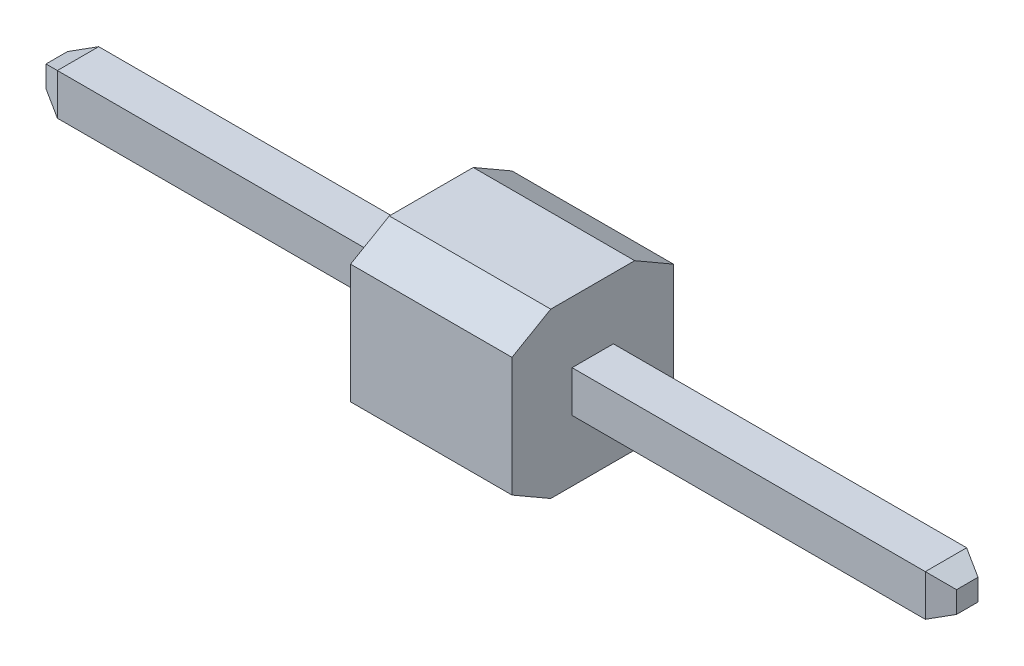
ISO-10303-21;
HEADER;
FILE_DESCRIPTION(('STEP AP214'),'2;1');
FILE_NAME('part.step','',(''),(''),'','','');
FILE_SCHEMA(('AUTOMOTIVE_DESIGN { 1 0 10303 214 1 1 1 1 }'));
ENDSEC;
DATA;
#1=APPLICATION_CONTEXT('core data for automotive mechanical design processes');
#2=APPLICATION_PROTOCOL_DEFINITION('international standard','automotive_design',2000,#1);
#3=PRODUCT_CONTEXT('',#1,'mechanical');
#4=PRODUCT('Part','Part','',(#3));
#5=PRODUCT_RELATED_PRODUCT_CATEGORY('part','',(#4));
#6=PRODUCT_DEFINITION_FORMATION('','',#4);
#7=PRODUCT_DEFINITION_CONTEXT('part definition',#1,'design');
#8=PRODUCT_DEFINITION('design','',#6,#7);
#9=PRODUCT_DEFINITION_SHAPE('','',#8);
#10=(LENGTH_UNIT() NAMED_UNIT(*) SI_UNIT(.MILLI.,.METRE.));
#11=(NAMED_UNIT(*) PLANE_ANGLE_UNIT() SI_UNIT($,.RADIAN.));
#12=(NAMED_UNIT(*) SI_UNIT($,.STERADIAN.) SOLID_ANGLE_UNIT());
#13=UNCERTAINTY_MEASURE_WITH_UNIT(LENGTH_MEASURE(1.E-05),#10,'distance_accuracy_value','');
#14=(GEOMETRIC_REPRESENTATION_CONTEXT(3) GLOBAL_UNCERTAINTY_ASSIGNED_CONTEXT((#13)) GLOBAL_UNIT_ASSIGNED_CONTEXT((#10,
#11,#12)) REPRESENTATION_CONTEXT('',''));
#15=CARTESIAN_POINT('',(0.,0.,0.));
#16=DIRECTION('',(0.,0.,1.));
#17=DIRECTION('',(1.,0.,0.));
#18=AXIS2_PLACEMENT_3D('',#15,#16,#17);
#19=CARTESIAN_POINT('',(5.42107461246523,7.30287173708609,0.629998634255617));
#20=DIRECTION('',(1.,4.37113882867379E-08,-4.37113882867379E-08));
#21=DIRECTION('',(-4.37113882867379E-08,1.,0.));
#22=AXIS2_PLACEMENT_3D('',#19,#20,#21);
#23=PLANE('',#22);
#24=DIRECTION('',(1.59994790123753E-08,0.50000000000019,0.866025403784329));
#25=VECTOR('',#24,1.);
#26=CARTESIAN_POINT('',(5.42107448947931,8.54646157557208,-0.940001365744382));
#27=LINE('',#26,#25);
#28=CARTESIAN_POINT('',(5.42107448947931,8.54646157557208,-0.940001365744382));
#29=VERTEX_POINT('',#28);
#30=CARTESIAN_POINT('',(5.42107450056408,8.89287173708609,-0.340001365744383));
#31=VERTEX_POINT('',#30);
#32=EDGE_CURVE('E11',#29,#31,#27,.T.);
#33=ORIENTED_EDGE('',*,*,#32,.T.);
#34=DIRECTION('',(4.37113886966664E-08,0.,0.999999999999999));
#35=VECTOR('',#34,1.);
#36=CARTESIAN_POINT('',(5.42107450056408,8.89287173708609,-0.340001365744383));
#37=LINE('',#36,#35);
#38=CARTESIAN_POINT('',(5.42107455738888,8.89287173708609,0.959998634255618));
#39=VERTEX_POINT('',#38);
#40=EDGE_CURVE('E304',#31,#39,#37,.T.);
#41=ORIENTED_EDGE('',*,*,#40,.T.);
#42=DIRECTION('',(5.97108656004285E-08,-0.500000000000188,0.866025403784328));
#43=VECTOR('',#42,1.);
#44=CARTESIAN_POINT('',(5.42107455738888,8.89287173708609,0.959998634255618));
#45=LINE('',#44,#43);
#46=CARTESIAN_POINT('',(5.42107459875778,8.54646157557209,1.55999863425562));
#47=VERTEX_POINT('',#46);
#48=EDGE_CURVE('E296',#39,#47,#45,.T.);
#49=ORIENTED_EDGE('',*,*,#48,.T.);
#50=DIRECTION('',(4.37113884815072E-08,-0.999999999999999,0.));
#51=VECTOR('',#50,1.);
#52=CARTESIAN_POINT('',(5.42107459875778,8.54646157557209,1.55999863425562));
#53=LINE('',#52,#51);
#54=CARTESIAN_POINT('',(5.42107467950057,6.69928189860009,1.55999863425562));
#55=VERTEX_POINT('',#54);
#56=EDGE_CURVE('E281',#47,#55,#53,.T.);
#57=ORIENTED_EDGE('',*,*,#56,.T.);
#58=DIRECTION('',(1.59994777304001E-08,0.500000000000191,0.866025403784328));
#59=VECTOR('',#58,1.);
#60=CARTESIAN_POINT('',(5.42107466841581,6.35287173708609,0.959998634255618));
#61=LINE('',#60,#59);
#62=CARTESIAN_POINT('',(5.42107466841581,6.35287173708609,0.959998634255618));
#63=VERTEX_POINT('',#62);
#64=EDGE_CURVE('E265',#63,#55,#61,.T.);
#65=ORIENTED_EDGE('',*,*,#64,.F.);
#66=DIRECTION('',(4.37113886966664E-08,0.,0.999999999999999));
#67=VECTOR('',#66,1.);
#68=CARTESIAN_POINT('',(5.421074611591,6.35287173708609,-0.340001365744383));
#69=LINE('',#68,#67);
#70=CARTESIAN_POINT('',(5.421074611591,6.35287173708609,-0.340001365744383));
#71=VERTEX_POINT('',#70);
#72=EDGE_CURVE('E248',#71,#63,#69,.T.);
#73=ORIENTED_EDGE('',*,*,#72,.F.);
#74=DIRECTION('',(5.97108668824036E-08,-0.500000000000189,0.866025403784328));
#75=VECTOR('',#74,1.);
#76=CARTESIAN_POINT('',(5.4210745702221,6.69928189860009,-0.940001365744382));
#77=LINE('',#76,#75);
#78=CARTESIAN_POINT('',(5.4210745702221,6.69928189860009,-0.940001365744382));
#79=VERTEX_POINT('',#78);
#80=EDGE_CURVE('E242',#79,#71,#77,.T.);
#81=ORIENTED_EDGE('',*,*,#80,.F.);
#82=DIRECTION('',(4.37113884815072E-08,-0.999999999999999,0.));
#83=VECTOR('',#82,1.);
#84=CARTESIAN_POINT('',(5.42107448947931,8.54646157557208,-0.940001365744382));
#85=LINE('',#84,#83);
#86=EDGE_CURVE('E236',#29,#79,#85,.T.);
#87=ORIENTED_EDGE('',*,*,#86,.F.);
#88=EDGE_LOOP('',(#33,#41,#49,#57,#65,#73,#81,#87));
#89=FACE_BOUND('',#88,.T.);
#90=DIRECTION('',(-4.37113886753159E-08,0.,-0.999999999999999));
#91=VECTOR('',#90,1.);
#92=CARTESIAN_POINT('',(5.42107458448994,7.94287173708609,0.629998634255617));
#93=LINE('',#92,#91);
#94=CARTESIAN_POINT('',(5.42107458448994,7.94287173708609,0.629998634255617));
#95=VERTEX_POINT('',#94);
#96=CARTESIAN_POINT('',(5.42107455651465,7.94287173708609,-0.0100013657443826));
#97=VERTEX_POINT('',#96);
#98=EDGE_CURVE('E302',#95,#97,#93,.T.);
#99=ORIENTED_EDGE('',*,*,#98,.T.);
#100=DIRECTION('',(-4.3711388675316E-08,0.999999999999999,0.));
#101=VECTOR('',#100,1.);
#102=CARTESIAN_POINT('',(5.42107458448994,7.30287173708609,-0.0100013657443826));
#103=LINE('',#102,#101);
#104=CARTESIAN_POINT('',(5.42107458448994,7.30287173708609,-0.0100013657443826));
#105=VERTEX_POINT('',#104);
#106=EDGE_CURVE('E293',#105,#97,#103,.T.);
#107=ORIENTED_EDGE('',*,*,#106,.F.);
#108=DIRECTION('',(-4.37113886753159E-08,0.,-0.999999999999999));
#109=VECTOR('',#108,1.);
#110=CARTESIAN_POINT('',(5.42107461246523,7.30287173708609,0.629998634255617));
#111=LINE('',#110,#109);
#112=CARTESIAN_POINT('',(5.42107461246523,7.30287173708609,0.629998634255617));
#113=VERTEX_POINT('',#112);
#114=EDGE_CURVE('E278',#113,#105,#111,.T.);
#115=ORIENTED_EDGE('',*,*,#114,.F.);
#116=DIRECTION('',(-4.3711388675316E-08,0.999999999999999,0.));
#117=VECTOR('',#116,1.);
#118=CARTESIAN_POINT('',(5.42107461246523,7.30287173708609,0.629998634255617));
#119=LINE('',#118,#117);
#120=EDGE_CURVE('E263',#113,#95,#119,.T.);
#121=ORIENTED_EDGE('',*,*,#120,.T.);
#122=EDGE_LOOP('',(#99,#107,#115,#121));
#123=FACE_BOUND('',#122,.T.);
#124=ADVANCED_FACE('F17',(#89,#123),#23,.T.);
#125=CARTESIAN_POINT('',(2.92107461246523,7.30287162780762,0.629998743534088));
#126=DIRECTION('',(1.,4.37113882867379E-08,-4.37113882867379E-08));
#127=DIRECTION('',(-4.37113882867379E-08,1.,0.));
#128=AXIS2_PLACEMENT_3D('',#125,#126,#127);
#129=PLANE('',#128);
#130=DIRECTION('',(1.59994783713877E-08,0.50000000000019,0.866025403784329));
#131=VECTOR('',#130,1.);
#132=CARTESIAN_POINT('',(2.92107448947931,8.54646146629361,-0.940001256465912));
#133=LINE('',#132,#131);
#134=CARTESIAN_POINT('',(2.92107448947931,8.54646146629361,-0.940001256465912));
#135=VERTEX_POINT('',#134);
#136=CARTESIAN_POINT('',(2.92107450056408,8.89287162780762,-0.340001256465912));
#137=VERTEX_POINT('',#136);
#138=EDGE_CURVE('E24',#135,#137,#133,.T.);
#139=ORIENTED_EDGE('',*,*,#138,.F.);
#140=DIRECTION('',(4.37113882410924E-08,-0.999999999999999,0.));
#141=VECTOR('',#140,1.);
#142=CARTESIAN_POINT('',(2.92107448947931,8.54646146629361,-0.940001256465912));
#143=LINE('',#142,#141);
#144=CARTESIAN_POINT('',(2.9210745702221,6.69928178932161,-0.940001256465912));
#145=VERTEX_POINT('',#144);
#146=EDGE_CURVE('E300',#135,#145,#143,.T.);
#147=ORIENTED_EDGE('',*,*,#146,.T.);
#148=DIRECTION('',(5.97108668824036E-08,-0.500000000000189,0.866025403784328));
#149=VECTOR('',#148,1.);
#150=CARTESIAN_POINT('',(2.9210745702221,6.69928178932161,-0.940001256465912));
#151=LINE('',#150,#149);
#152=CARTESIAN_POINT('',(2.921074611591,6.35287162780762,-0.340001256465912));
#153=VERTEX_POINT('',#152);
#154=EDGE_CURVE('E286',#145,#153,#151,.T.);
#155=ORIENTED_EDGE('',*,*,#154,.T.);
#156=DIRECTION('',(4.37113883550593E-08,0.,0.999999999999999));
#157=VECTOR('',#156,1.);
#158=CARTESIAN_POINT('',(2.921074611591,6.35287162780762,-0.340001256465912));
#159=LINE('',#158,#157);
#160=CARTESIAN_POINT('',(2.92107466841581,6.35287162780762,0.959998743534088));
#161=VERTEX_POINT('',#160);
#162=EDGE_CURVE('E271',#153,#161,#159,.T.);
#163=ORIENTED_EDGE('',*,*,#162,.T.);
#164=DIRECTION('',(1.59994783713877E-08,0.500000000000191,0.866025403784328));
#165=VECTOR('',#164,1.);
#166=CARTESIAN_POINT('',(2.92107466841581,6.35287162780762,0.959998743534088));
#167=LINE('',#166,#165);
#168=CARTESIAN_POINT('',(2.92107467950057,6.69928178932162,1.55999874353409));
#169=VERTEX_POINT('',#168);
#170=EDGE_CURVE('E253',#161,#169,#167,.T.);
#171=ORIENTED_EDGE('',*,*,#170,.T.);
#172=DIRECTION('',(4.37113882410924E-08,-0.999999999999999,0.));
#173=VECTOR('',#172,1.);
#174=CARTESIAN_POINT('',(2.92107459875778,8.54646146629362,1.55999874353409));
#175=LINE('',#174,#173);
#176=CARTESIAN_POINT('',(2.92107459875778,8.54646146629362,1.55999874353409));
#177=VERTEX_POINT('',#176);
#178=EDGE_CURVE('E261',#177,#169,#175,.T.);
#179=ORIENTED_EDGE('',*,*,#178,.F.);
#180=DIRECTION('',(5.97108668824036E-08,-0.500000000000188,0.866025403784328));
#181=VECTOR('',#180,1.);
#182=CARTESIAN_POINT('',(2.92107455738888,8.89287162780762,0.959998743534088));
#183=LINE('',#182,#181);
#184=CARTESIAN_POINT('',(2.92107455738888,8.89287162780762,0.959998743534088));
#185=VERTEX_POINT('',#184);
#186=EDGE_CURVE('E276',#185,#177,#183,.T.);
#187=ORIENTED_EDGE('',*,*,#186,.F.);
#188=DIRECTION('',(4.37113883550593E-08,0.,0.999999999999999));
#189=VECTOR('',#188,1.);
#190=CARTESIAN_POINT('',(2.92107450056408,8.89287162780762,-0.340001256465912));
#191=LINE('',#190,#189);
#192=EDGE_CURVE('E291',#137,#185,#191,.T.);
#193=ORIENTED_EDGE('',*,*,#192,.F.);
#194=EDGE_LOOP('',(#139,#147,#155,#163,#171,#179,#187,#193));
#195=FACE_BOUND('',#194,.T.);
#196=DIRECTION('',(-4.37113879814266E-08,0.999999999999999,0.));
#197=VECTOR('',#196,1.);
#198=CARTESIAN_POINT('',(2.92107458448994,7.30287162780762,-0.0100012564659119));
#199=LINE('',#198,#197);
#200=CARTESIAN_POINT('',(2.92107458448994,7.30287162780762,-0.0100012564659119));
#201=VERTEX_POINT('',#200);
#202=CARTESIAN_POINT('',(2.92107455651465,7.94287162780762,-0.0100012564659119));
#203=VERTEX_POINT('',#202);
#204=EDGE_CURVE('E298',#201,#203,#199,.T.);
#205=ORIENTED_EDGE('',*,*,#204,.T.);
#206=DIRECTION('',(-4.37113879814266E-08,0.,-0.999999999999999));
#207=VECTOR('',#206,1.);
#208=CARTESIAN_POINT('',(2.92107458448994,7.94287162780762,0.629998743534088));
#209=LINE('',#208,#207);
#210=CARTESIAN_POINT('',(2.92107458448994,7.94287162780762,0.629998743534088));
#211=VERTEX_POINT('',#210);
#212=EDGE_CURVE('E283',#211,#203,#209,.T.);
#213=ORIENTED_EDGE('',*,*,#212,.F.);
#214=DIRECTION('',(-4.3711388675316E-08,0.999999999999999,0.));
#215=VECTOR('',#214,1.);
#216=CARTESIAN_POINT('',(2.92107461246523,7.30287162780762,0.629998743534088));
#217=LINE('',#216,#215);
#218=CARTESIAN_POINT('',(2.92107461246523,7.30287162780762,0.629998743534088));
#219=VERTEX_POINT('',#218);
#220=EDGE_CURVE('E268',#219,#211,#217,.T.);
#221=ORIENTED_EDGE('',*,*,#220,.F.);
#222=DIRECTION('',(-4.37113886753159E-08,0.,-0.999999999999999));
#223=VECTOR('',#222,1.);
#224=CARTESIAN_POINT('',(2.92107461246523,7.30287162780762,0.629998743534088));
#225=LINE('',#224,#223);
#226=EDGE_CURVE('E251',#219,#201,#225,.T.);
#227=ORIENTED_EDGE('',*,*,#226,.T.);
#228=EDGE_LOOP('',(#205,#213,#221,#227));
#229=FACE_BOUND('',#228,.T.);
#230=ADVANCED_FACE('F314',(#195,#229),#129,.F.);
#231=CARTESIAN_POINT('',(5.42107448947931,8.54646157557208,-0.940001365744382));
#232=DIRECTION('',(5.97108668343731E-08,-0.866025403784328,0.50000000000019));
#233=DIRECTION('',(-1.59994785476185E-08,-0.500000000000192,-0.866025403784329));
#234=AXIS2_PLACEMENT_3D('',#231,#232,#233);
#235=PLANE('',#234);
#236=ORIENTED_EDGE('',*,*,#138,.T.);
#237=DIRECTION('',(-0.999999999999998,-4.37113882867378E-08,4.37113883755557E-08));
#238=VECTOR('',#237,1.);
#239=CARTESIAN_POINT('',(5.42107450056408,8.89287173708609,-0.340001365744383));
#240=LINE('',#239,#238);
#241=EDGE_CURVE('E288',#31,#137,#240,.T.);
#242=ORIENTED_EDGE('',*,*,#241,.F.);
#243=ORIENTED_EDGE('',*,*,#32,.F.);
#244=DIRECTION('',(-0.999999999999998,-4.37113882867378E-08,4.37113881091022E-08));
#245=VECTOR('',#244,1.);
#246=CARTESIAN_POINT('',(5.42107448947931,8.54646157557208,-0.940001365744382));
#247=LINE('',#246,#245);
#248=EDGE_CURVE('E256',#29,#135,#247,.T.);
#249=ORIENTED_EDGE('',*,*,#248,.T.);
#250=EDGE_LOOP('',(#236,#242,#243,#249));
#251=FACE_BOUND('',#250,.T.);
#252=ADVANCED_FACE('F306',(#251),#235,.F.);
#253=CARTESIAN_POINT('',(5.42107450056408,8.89287173708609,-0.340001365744383));
#254=DIRECTION('',(4.37113882867379E-08,-1.,0.));
#255=DIRECTION('',(1.,4.37113882867379E-08,-4.37113882867379E-08));
#256=AXIS2_PLACEMENT_3D('',#253,#254,#255);
#257=PLANE('',#256);
#258=ORIENTED_EDGE('',*,*,#192,.T.);
#259=DIRECTION('',(-0.999999999999998,-4.37113882867378E-08,4.37113882867378E-08));
#260=VECTOR('',#259,1.);
#261=CARTESIAN_POINT('',(5.42107455738888,8.89287173708609,0.959998634255618));
#262=LINE('',#261,#260);
#263=EDGE_CURVE('E273',#39,#185,#262,.T.);
#264=ORIENTED_EDGE('',*,*,#263,.F.);
#265=ORIENTED_EDGE('',*,*,#40,.F.);
#266=ORIENTED_EDGE('',*,*,#241,.T.);
#267=EDGE_LOOP('',(#258,#264,#265,#266));
#268=FACE_BOUND('',#267,.T.);
#269=ADVANCED_FACE('F311',(#268),#257,.F.);
#270=CARTESIAN_POINT('',(5.42107455738888,8.89287173708609,0.959998634255618));
#271=DIRECTION('',(1.59994785476185E-08,-0.86602540378433,-0.50000000000019));
#272=DIRECTION('',(-5.97108668343731E-08,0.500000000000188,-0.866025403784329));
#273=AXIS2_PLACEMENT_3D('',#270,#271,#272);
#274=PLANE('',#273);
#275=ORIENTED_EDGE('',*,*,#186,.T.);
#276=DIRECTION('',(-0.999999999999998,-4.37113875761951E-08,4.37113882867378E-08));
#277=VECTOR('',#276,1.);
#278=CARTESIAN_POINT('',(5.42107459875778,8.54646157557209,1.55999863425562));
#279=LINE('',#278,#277);
#280=EDGE_CURVE('E258',#47,#177,#279,.T.);
#281=ORIENTED_EDGE('',*,*,#280,.F.);
#282=ORIENTED_EDGE('',*,*,#48,.F.);
#283=ORIENTED_EDGE('',*,*,#263,.T.);
#284=EDGE_LOOP('',(#275,#281,#282,#283));
#285=FACE_BOUND('',#284,.T.);
#286=ADVANCED_FACE('F319',(#285),#274,.F.);
#287=CARTESIAN_POINT('',(5.42107459875778,8.54646157557209,1.55999863425562));
#288=DIRECTION('',(-4.37113882867379E-08,0.,-1.));
#289=DIRECTION('',(-1.,-4.37113882867379E-08,4.37113882867379E-08));
#290=AXIS2_PLACEMENT_3D('',#287,#288,#289);
#291=PLANE('',#290);
#292=ORIENTED_EDGE('',*,*,#178,.T.);
#293=DIRECTION('',(-0.999999999999998,-4.37113882867378E-08,4.37113882867378E-08));
#294=VECTOR('',#293,1.);
#295=CARTESIAN_POINT('',(5.42107467950057,6.69928189860009,1.55999863425562));
#296=LINE('',#295,#294);
#297=EDGE_CURVE('E245',#55,#169,#296,.T.);
#298=ORIENTED_EDGE('',*,*,#297,.F.);
#299=ORIENTED_EDGE('',*,*,#56,.F.);
#300=ORIENTED_EDGE('',*,*,#280,.T.);
#301=EDGE_LOOP('',(#292,#298,#299,#300));
#302=FACE_BOUND('',#301,.T.);
#303=ADVANCED_FACE('F326',(#302),#291,.F.);
#304=CARTESIAN_POINT('',(5.42107466841581,6.35287173708609,0.959998634255618));
#305=DIRECTION('',(5.97108668343731E-08,-0.866025403784328,0.50000000000019));
#306=DIRECTION('',(-1.59994785476185E-08,-0.500000000000192,-0.866025403784329));
#307=AXIS2_PLACEMENT_3D('',#304,#305,#306);
#308=PLANE('',#307);
#309=ORIENTED_EDGE('',*,*,#170,.F.);
#310=DIRECTION('',(-0.999999999999998,-4.37113886420092E-08,4.37113882867378E-08));
#311=VECTOR('',#310,1.);
#312=CARTESIAN_POINT('',(5.42107466841581,6.35287173708609,0.959998634255618));
#313=LINE('',#312,#311);
#314=EDGE_CURVE('E239',#63,#161,#313,.T.);
#315=ORIENTED_EDGE('',*,*,#314,.F.);
#316=ORIENTED_EDGE('',*,*,#64,.T.);
#317=ORIENTED_EDGE('',*,*,#297,.T.);
#318=EDGE_LOOP('',(#309,#315,#316,#317));
#319=FACE_BOUND('',#318,.T.);
#320=ADVANCED_FACE('F329',(#319),#308,.T.);
#321=CARTESIAN_POINT('',(5.421074611591,6.35287173708609,-0.340001365744383));
#322=DIRECTION('',(4.37113882867379E-08,-1.,0.));
#323=DIRECTION('',(1.,4.37113882867379E-08,-4.37113882867379E-08));
#324=AXIS2_PLACEMENT_3D('',#321,#322,#323);
#325=PLANE('',#324);
#326=ORIENTED_EDGE('',*,*,#162,.F.);
#327=DIRECTION('',(-0.999999999999998,-4.37113886420092E-08,4.37113883755557E-08));
#328=VECTOR('',#327,1.);
#329=CARTESIAN_POINT('',(5.421074611591,6.35287173708609,-0.340001365744383));
#330=LINE('',#329,#328);
#331=EDGE_CURVE('E233',#71,#153,#330,.T.);
#332=ORIENTED_EDGE('',*,*,#331,.F.);
#333=ORIENTED_EDGE('',*,*,#72,.T.);
#334=ORIENTED_EDGE('',*,*,#314,.T.);
#335=EDGE_LOOP('',(#326,#332,#333,#334));
#336=FACE_BOUND('',#335,.T.);
#337=ADVANCED_FACE('F333',(#336),#325,.T.);
#338=CARTESIAN_POINT('',(5.4210745702221,6.69928189860009,-0.940001365744382));
#339=DIRECTION('',(1.59994785476185E-08,-0.86602540378433,-0.50000000000019));
#340=DIRECTION('',(-5.97108668343731E-08,0.500000000000188,-0.866025403784329));
#341=AXIS2_PLACEMENT_3D('',#338,#339,#340);
#342=PLANE('',#341);
#343=ORIENTED_EDGE('',*,*,#154,.F.);
#344=DIRECTION('',(-0.999999999999998,-4.37113882867378E-08,4.37113881091022E-08));
#345=VECTOR('',#344,1.);
#346=CARTESIAN_POINT('',(5.4210745702221,6.69928189860009,-0.940001365744382));
#347=LINE('',#346,#345);
#348=EDGE_CURVE('E230',#79,#145,#347,.T.);
#349=ORIENTED_EDGE('',*,*,#348,.F.);
#350=ORIENTED_EDGE('',*,*,#80,.T.);
#351=ORIENTED_EDGE('',*,*,#331,.T.);
#352=EDGE_LOOP('',(#343,#349,#350,#351));
#353=FACE_BOUND('',#352,.T.);
#354=ADVANCED_FACE('F337',(#353),#342,.T.);
#355=CARTESIAN_POINT('',(5.42107448947931,8.54646157557208,-0.940001365744382));
#356=DIRECTION('',(-4.37113882867379E-08,0.,-1.));
#357=DIRECTION('',(-4.37113882867379E-08,1.,0.));
#358=AXIS2_PLACEMENT_3D('',#355,#356,#357);
#359=PLANE('',#358);
#360=ORIENTED_EDGE('',*,*,#146,.F.);
#361=ORIENTED_EDGE('',*,*,#248,.F.);
#362=ORIENTED_EDGE('',*,*,#86,.T.);
#363=ORIENTED_EDGE('',*,*,#348,.T.);
#364=EDGE_LOOP('',(#360,#361,#362,#363));
#365=FACE_BOUND('',#364,.T.);
#366=ADVANCED_FACE('F339',(#365),#359,.T.);
#367=CARTESIAN_POINT('',(-2.87892538753477,7.30287137428157,0.62999899706014));
#368=DIRECTION('',(-1.,-4.37113882867379E-08,4.37113882867379E-08));
#369=DIRECTION('',(4.37113882867379E-08,-1.,0.));
#370=AXIS2_PLACEMENT_3D('',#367,#368,#369);
#371=PLANE('',#370);
#372=DIRECTION('',(4.37113847280434E-08,-0.999999999999999,0.));
#373=VECTOR('',#372,1.);
#374=CARTESIAN_POINT('',(-2.8789254300326,7.78898984709056,0.14388052425114));
#375=LINE('',#374,#373);
#376=CARTESIAN_POINT('',(-2.8789254300326,7.78898984709056,0.14388052425114));
#377=VERTEX_POINT('',#376);
#378=CARTESIAN_POINT('',(-2.87892541551006,7.45675290147256,0.14388052425114));
#379=VERTEX_POINT('',#378);
#380=EDGE_CURVE('E228',#377,#379,#375,.T.);
#381=ORIENTED_EDGE('',*,*,#380,.T.);
#382=DIRECTION('',(4.37113874013716E-08,0.,0.999999999999999));
#383=VECTOR('',#382,1.);
#384=CARTESIAN_POINT('',(-2.87892541551006,7.45675290147256,0.14388052425114));
#385=LINE('',#384,#383);
#386=CARTESIAN_POINT('',(-2.87892540098752,7.45675290147257,0.47611746986914));
#387=VERTEX_POINT('',#386);
#388=EDGE_CURVE('E223',#379,#387,#385,.T.);
#389=ORIENTED_EDGE('',*,*,#388,.T.);
#390=DIRECTION('',(-4.37113900746999E-08,0.999999999999999,0.));
#391=VECTOR('',#390,1.);
#392=CARTESIAN_POINT('',(-2.87892540098752,7.45675290147257,0.47611746986914));
#393=LINE('',#392,#391);
#394=CARTESIAN_POINT('',(-2.87892541551006,7.78898984709057,0.47611746986914));
#395=VERTEX_POINT('',#394);
#396=EDGE_CURVE('E215',#387,#395,#393,.T.);
#397=ORIENTED_EDGE('',*,*,#396,.T.);
#398=DIRECTION('',(-4.37113820547151E-08,0.,-0.999999999999999));
#399=VECTOR('',#398,1.);
#400=CARTESIAN_POINT('',(-2.87892541551006,7.78898984709057,0.47611746986914));
#401=LINE('',#400,#399);
#402=EDGE_CURVE('E207',#395,#377,#401,.T.);
#403=ORIENTED_EDGE('',*,*,#402,.T.);
#404=EDGE_LOOP('',(#381,#389,#397,#403));
#405=FACE_BOUND('',#404,.T.);
#406=ADVANCED_FACE('F341',(#405),#371,.T.);
#407=CARTESIAN_POINT('',(-2.87892538753477,7.30287137428157,0.62999899706014));
#408=DIRECTION('',(4.37113882867379E-08,-1.,0.));
#409=DIRECTION('',(-4.37113882867379E-08,0.,-1.));
#410=AXIS2_PLACEMENT_3D('',#407,#408,#409);
#411=PLANE('',#410);
#412=DIRECTION('',(0.999999999999998,4.37113886829271E-08,-4.37113882769955E-08));
#413=VECTOR('',#412,1.);
#414=CARTESIAN_POINT('',(-2.54892538753477,7.30287138870632,0.629998982635382));
#415=LINE('',#414,#413);
#416=CARTESIAN_POINT('',(-2.54892538753477,7.30287138870632,0.629998982635382));
#417=VERTEX_POINT('',#416);
#418=EDGE_CURVE('E225',#417,#219,#415,.T.);
#419=ORIENTED_EDGE('',*,*,#418,.F.);
#420=DIRECTION('',(-4.37113886753159E-08,0.,-0.999999999999999));
#421=VECTOR('',#420,1.);
#422=CARTESIAN_POINT('',(-2.54892538753477,7.30287138870632,0.629998982635382));
#423=LINE('',#422,#421);
#424=CARTESIAN_POINT('',(-2.54892541551006,7.30287138870632,-0.010001017364618));
#425=VERTEX_POINT('',#424);
#426=EDGE_CURVE('E217',#417,#425,#423,.T.);
#427=ORIENTED_EDGE('',*,*,#426,.T.);
#428=DIRECTION('',(0.999999999999998,4.37113886829271E-08,-4.37113882161057E-08));
#429=VECTOR('',#428,1.);
#430=CARTESIAN_POINT('',(-2.54892541551006,7.30287138870632,-0.010001017364618));
#431=LINE('',#430,#429);
#432=EDGE_CURVE('E220',#425,#201,#431,.T.);
#433=ORIENTED_EDGE('',*,*,#432,.T.);
#434=ORIENTED_EDGE('',*,*,#226,.F.);
#435=EDGE_LOOP('',(#419,#427,#433,#434));
#436=FACE_BOUND('',#435,.T.);
#437=ADVANCED_FACE('F348',(#436),#411,.T.);
#438=CARTESIAN_POINT('',(-2.87892541551006,7.30287137428156,-0.0100010029398598));
#439=DIRECTION('',(-4.37113882867379E-08,0.,-1.));
#440=DIRECTION('',(-1.,-4.37113882867379E-08,4.37113882867379E-08));
#441=AXIS2_PLACEMENT_3D('',#438,#439,#440);
#442=PLANE('',#441);
#443=ORIENTED_EDGE('',*,*,#432,.F.);
#444=DIRECTION('',(-4.3711388675316E-08,0.999999999999999,0.));
#445=VECTOR('',#444,1.);
#446=CARTESIAN_POINT('',(-2.54892541551006,7.30287138870632,-0.010001017364618));
#447=LINE('',#446,#445);
#448=CARTESIAN_POINT('',(-2.54892544348535,7.94287138870632,-0.010001017364618));
#449=VERTEX_POINT('',#448);
#450=EDGE_CURVE('E209',#425,#449,#447,.T.);
#451=ORIENTED_EDGE('',*,*,#450,.T.);
#452=DIRECTION('',(0.999999999999998,4.37113881958092E-08,-4.37113882161057E-08));
#453=VECTOR('',#452,1.);
#454=CARTESIAN_POINT('',(-2.54892544348535,7.94287138870632,-0.010001017364618));
#455=LINE('',#454,#453);
#456=EDGE_CURVE('E212',#449,#203,#455,.T.);
#457=ORIENTED_EDGE('',*,*,#456,.T.);
#458=ORIENTED_EDGE('',*,*,#204,.F.);
#459=EDGE_LOOP('',(#443,#451,#457,#458));
#460=FACE_BOUND('',#459,.T.);
#461=ADVANCED_FACE('F424',(#460),#442,.T.);
#462=CARTESIAN_POINT('',(-2.87892541551006,7.94287137428156,0.62999899706014));
#463=DIRECTION('',(4.37113882867379E-08,-1.,0.));
#464=DIRECTION('',(-4.37113882867379E-08,0.,-1.));
#465=AXIS2_PLACEMENT_3D('',#462,#463,#464);
#466=PLANE('',#465);
#467=ORIENTED_EDGE('',*,*,#456,.F.);
#468=DIRECTION('',(4.37113900630947E-08,0.,0.999999999999999));
#469=VECTOR('',#468,1.);
#470=CARTESIAN_POINT('',(-2.54892544348535,7.94287138870632,-0.010001017364618));
#471=LINE('',#470,#469);
#472=CARTESIAN_POINT('',(-2.54892541551006,7.94287138870632,0.629998982635382));
#473=VERTEX_POINT('',#472);
#474=EDGE_CURVE('E201',#449,#473,#471,.T.);
#475=ORIENTED_EDGE('',*,*,#474,.T.);
#476=DIRECTION('',(0.999999999999998,4.37113881958092E-08,-4.37113882769955E-08));
#477=VECTOR('',#476,1.);
#478=CARTESIAN_POINT('',(-2.54892541551006,7.94287138870632,0.629998982635382));
#479=LINE('',#478,#477);
#480=EDGE_CURVE('E204',#473,#211,#479,.T.);
#481=ORIENTED_EDGE('',*,*,#480,.T.);
#482=ORIENTED_EDGE('',*,*,#212,.T.);
#483=EDGE_LOOP('',(#467,#475,#481,#482));
#484=FACE_BOUND('',#483,.T.);
#485=ADVANCED_FACE('F421',(#484),#466,.F.);
#486=CARTESIAN_POINT('',(-2.87892538753477,7.30287137428157,0.62999899706014));
#487=DIRECTION('',(-4.37113882867379E-08,0.,-1.));
#488=DIRECTION('',(-1.,-4.37113882867379E-08,4.37113882867379E-08));
#489=AXIS2_PLACEMENT_3D('',#486,#487,#488);
#490=PLANE('',#489);
#491=ORIENTED_EDGE('',*,*,#480,.F.);
#492=DIRECTION('',(4.37113872875372E-08,-0.999999999999999,0.));
#493=VECTOR('',#492,1.);
#494=CARTESIAN_POINT('',(-2.54892541551006,7.94287138870632,0.629998982635382));
#495=LINE('',#494,#493);
#496=EDGE_CURVE('E196',#473,#417,#495,.T.);
#497=ORIENTED_EDGE('',*,*,#496,.T.);
#498=ORIENTED_EDGE('',*,*,#418,.T.);
#499=ORIENTED_EDGE('',*,*,#220,.T.);
#500=EDGE_LOOP('',(#491,#497,#498,#499));
#501=FACE_BOUND('',#500,.T.);
#502=ADVANCED_FACE('F376',(#501),#490,.F.);
#503=CARTESIAN_POINT('',(-2.87892538753477,7.30287137428157,0.62999899706014));
#504=DIRECTION('',(-4.37113882867379E-08,0.,-1.));
#505=DIRECTION('',(-1.,-4.37113882867379E-08,4.37113882867379E-08));
#506=AXIS2_PLACEMENT_3D('',#503,#504,#505);
#507=PLANE('',#506);
#508=DIRECTION('',(0.999999999999998,4.37113883581818E-08,-4.37113882769955E-08));
#509=VECTOR('',#508,1.);
#510=CARTESIAN_POINT('',(5.42107461246523,7.30287173708609,0.629998634255617));
#511=LINE('',#510,#509);
#512=CARTESIAN_POINT('',(10.8910746124652,7.30287197618738,0.629998395154324));
#513=VERTEX_POINT('',#512);
#514=EDGE_CURVE('E199',#113,#513,#511,.T.);
#515=ORIENTED_EDGE('',*,*,#514,.T.);
#516=DIRECTION('',(-4.37113900630947E-08,0.999999999999999,0.));
#517=VECTOR('',#516,1.);
#518=CARTESIAN_POINT('',(10.8910746124652,7.30287197618738,0.629998395154324));
#519=LINE('',#518,#517);
#520=CARTESIAN_POINT('',(10.8910745844899,7.94287197618738,0.629998395154324));
#521=VERTEX_POINT('',#520);
#522=EDGE_CURVE('E191',#513,#521,#519,.T.);
#523=ORIENTED_EDGE('',*,*,#522,.T.);
#524=DIRECTION('',(0.999999999999998,4.37113883581818E-08,-4.37113882769955E-08));
#525=VECTOR('',#524,1.);
#526=CARTESIAN_POINT('',(5.42107458448994,7.94287173708609,0.629998634255617));
#527=LINE('',#526,#525);
#528=EDGE_CURVE('E194',#95,#521,#527,.T.);
#529=ORIENTED_EDGE('',*,*,#528,.F.);
#530=ORIENTED_EDGE('',*,*,#120,.F.);
#531=EDGE_LOOP('',(#515,#523,#529,#530));
#532=FACE_BOUND('',#531,.T.);
#533=ADVANCED_FACE('F367',(#532),#507,.F.);
#534=CARTESIAN_POINT('',(-2.87892541551006,7.94287137428156,0.62999899706014));
#535=DIRECTION('',(4.37113882867379E-08,-1.,0.));
#536=DIRECTION('',(-4.37113882867379E-08,0.,-1.));
#537=AXIS2_PLACEMENT_3D('',#534,#535,#536);
#538=PLANE('',#537);
#539=ORIENTED_EDGE('',*,*,#528,.T.);
#540=DIRECTION('',(-4.37113900630947E-08,0.,-0.999999999999999));
#541=VECTOR('',#540,1.);
#542=CARTESIAN_POINT('',(10.8910745844899,7.94287197618738,0.629998395154324));
#543=LINE('',#542,#541);
#544=CARTESIAN_POINT('',(10.8910745565147,7.94287197618738,-0.0100016048456765));
#545=VERTEX_POINT('',#544);
#546=EDGE_CURVE('E186',#521,#545,#543,.T.);
#547=ORIENTED_EDGE('',*,*,#546,.T.);
#548=DIRECTION('',(0.999999999999998,4.37113883581818E-08,-4.37113881146228E-08));
#549=VECTOR('',#548,1.);
#550=CARTESIAN_POINT('',(5.42107455651465,7.94287173708609,-0.0100013657443823));
#551=LINE('',#550,#549);
#552=EDGE_CURVE('E189',#97,#545,#551,.T.);
#553=ORIENTED_EDGE('',*,*,#552,.F.);
#554=ORIENTED_EDGE('',*,*,#98,.F.);
#555=EDGE_LOOP('',(#539,#547,#553,#554));
#556=FACE_BOUND('',#555,.T.);
#557=ADVANCED_FACE('F364',(#556),#538,.F.);
#558=CARTESIAN_POINT('',(-2.87892541551006,7.30287137428156,-0.0100010029398598));
#559=DIRECTION('',(-4.37113882867379E-08,0.,-1.));
#560=DIRECTION('',(-1.,-4.37113882867379E-08,4.37113882867379E-08));
#561=AXIS2_PLACEMENT_3D('',#558,#559,#560);
#562=PLANE('',#561);
#563=ORIENTED_EDGE('',*,*,#552,.T.);
#564=DIRECTION('',(4.37113872875372E-08,-0.999999999999999,0.));
#565=VECTOR('',#564,1.);
#566=CARTESIAN_POINT('',(10.8910745565147,7.94287197618738,-0.0100016048456766));
#567=LINE('',#566,#565);
#568=CARTESIAN_POINT('',(10.8910745844899,7.30287197618738,-0.0100016048456765));
#569=VERTEX_POINT('',#568);
#570=EDGE_CURVE('E176',#545,#569,#567,.T.);
#571=ORIENTED_EDGE('',*,*,#570,.T.);
#572=DIRECTION('',(0.999999999999998,4.37113883581818E-08,-4.37113881146228E-08));
#573=VECTOR('',#572,1.);
#574=CARTESIAN_POINT('',(5.42107458448994,7.30287173708609,-0.0100013657443823));
#575=LINE('',#574,#573);
#576=EDGE_CURVE('E179',#105,#569,#575,.T.);
#577=ORIENTED_EDGE('',*,*,#576,.F.);
#578=ORIENTED_EDGE('',*,*,#106,.T.);
#579=EDGE_LOOP('',(#563,#571,#577,#578));
#580=FACE_BOUND('',#579,.T.);
#581=ADVANCED_FACE('F366',(#580),#562,.T.);
#582=CARTESIAN_POINT('',(-2.87892538753477,7.30287137428157,0.62999899706014));
#583=DIRECTION('',(4.37113882867379E-08,-1.,0.));
#584=DIRECTION('',(-4.37113882867379E-08,0.,-1.));
#585=AXIS2_PLACEMENT_3D('',#582,#583,#584);
#586=PLANE('',#585);
#587=ORIENTED_EDGE('',*,*,#576,.T.);
#588=DIRECTION('',(4.37113845119796E-08,0.,0.999999999999999));
#589=VECTOR('',#588,1.);
#590=CARTESIAN_POINT('',(10.8910745844899,7.30287197618738,-0.0100016048456765));
#591=LINE('',#590,#589);
#592=EDGE_CURVE('E167',#569,#513,#591,.T.);
#593=ORIENTED_EDGE('',*,*,#592,.T.);
#594=ORIENTED_EDGE('',*,*,#514,.F.);
#595=ORIENTED_EDGE('',*,*,#114,.T.);
#596=EDGE_LOOP('',(#587,#593,#594,#595));
#597=FACE_BOUND('',#596,.T.);
#598=ADVANCED_FACE('F373',(#597),#586,.T.);
#599=CARTESIAN_POINT('',(11.2210746124652,7.30287199061214,0.629998380729565));
#600=DIRECTION('',(-1.,-4.37113882867379E-08,4.37113882867379E-08));
#601=DIRECTION('',(4.37113882867379E-08,-1.,0.));
#602=AXIS2_PLACEMENT_3D('',#599,#600,#601);
#603=PLANE('',#602);
#604=DIRECTION('',(-4.37113927480282E-08,0.999999999999999,0.));
#605=VECTOR('',#604,1.);
#606=CARTESIAN_POINT('',(11.2210745844899,7.45675351780314,0.143879907920565));
#607=LINE('',#606,#605);
#608=CARTESIAN_POINT('',(11.2210745844899,7.45675351780314,0.143879907920565));
#609=VERTEX_POINT('',#608);
#610=CARTESIAN_POINT('',(11.2210745699674,7.78899046342114,0.143879907920565));
#611=VERTEX_POINT('',#610);
#612=EDGE_CURVE('E153',#609,#611,#607,.T.);
#613=ORIENTED_EDGE('',*,*,#612,.T.);
#614=DIRECTION('',(4.37113927480282E-08,0.,0.999999999999999));
#615=VECTOR('',#614,1.);
#616=CARTESIAN_POINT('',(11.2210745699674,7.78899046342114,0.143879907920565));
#617=LINE('',#616,#615);
#618=CARTESIAN_POINT('',(11.2210745844899,7.78899046342114,0.476116853538565));
#619=VERTEX_POINT('',#618);
#620=EDGE_CURVE('E395',#611,#619,#617,.T.);
#621=ORIENTED_EDGE('',*,*,#620,.T.);
#622=DIRECTION('',(4.37113874013716E-08,-0.999999999999999,0.));
#623=VECTOR('',#622,1.);
#624=CARTESIAN_POINT('',(11.2210745844899,7.78899046342114,0.476116853538565));
#625=LINE('',#624,#623);
#626=CARTESIAN_POINT('',(11.2210745990125,7.45675351780314,0.476116853538565));
#627=VERTEX_POINT('',#626);
#628=EDGE_CURVE('E156',#619,#627,#625,.T.);
#629=ORIENTED_EDGE('',*,*,#628,.T.);
#630=DIRECTION('',(-4.37113927480282E-08,0.,-0.999999999999999));
#631=VECTOR('',#630,1.);
#632=CARTESIAN_POINT('',(11.2210745990125,7.45675351780314,0.476116853538565));
#633=LINE('',#632,#631);
#634=EDGE_CURVE('E149',#627,#609,#633,.T.);
#635=ORIENTED_EDGE('',*,*,#634,.T.);
#636=EDGE_LOOP('',(#613,#621,#629,#635));
#637=FACE_BOUND('',#636,.T.);
#638=ADVANCED_FACE('F151',(#637),#603,.F.);
#639=CARTESIAN_POINT('',(-2.87892540878368,7.78898984709057,0.62999899706014));
#640=DIRECTION('',(-0.422618301356784,0.906307768563367,1.84732310895534E-08));
#641=DIRECTION('',(4.37113882867379E-08,0.,1.));
#642=AXIS2_PLACEMENT_3D('',#639,#640,#641);
#643=PLANE('',#642);
#644=DIRECTION('',(0.834817095446926,0.389281657126018,-0.389281657126018));
#645=VECTOR('',#644,1.);
#646=CARTESIAN_POINT('',(-2.87892543003229,7.78898984709023,0.143880524251471));
#647=LINE('',#646,#645);
#648=EDGE_CURVE('E181',#377,#449,#647,.T.);
#649=ORIENTED_EDGE('',*,*,#648,.F.);
#650=ORIENTED_EDGE('',*,*,#402,.F.);
#651=DIRECTION('',(-0.834817129479007,-0.389281657126017,-0.389281584143988));
#652=VECTOR('',#651,1.);
#653=CARTESIAN_POINT('',(-2.54892541550984,7.94287138870609,0.629998982635147));
#654=LINE('',#653,#652);
#655=EDGE_CURVE('E404',#473,#395,#654,.T.);
#656=ORIENTED_EDGE('',*,*,#655,.F.);
#657=ORIENTED_EDGE('',*,*,#474,.F.);
#658=EDGE_LOOP('',(#649,#650,#656,#657));
#659=FACE_BOUND('',#658,.T.);
#660=ADVANCED_FACE('F418',(#659),#643,.T.);
#661=CARTESIAN_POINT('',(-2.87892539426115,7.30287137428157,0.47611746986914));
#662=DIRECTION('',(-0.422618222124841,-1.84732292043498E-08,0.906307805509828));
#663=DIRECTION('',(4.37113882867379E-08,-1.,0.));
#664=AXIS2_PLACEMENT_3D('',#661,#662,#663);
#665=PLANE('',#664);
#666=ORIENTED_EDGE('',*,*,#655,.T.);
#667=ORIENTED_EDGE('',*,*,#396,.F.);
#668=DIRECTION('',(-0.834817163511087,0.389281584143987,-0.389281584143986));
#669=VECTOR('',#668,1.);
#670=CARTESIAN_POINT('',(-2.5489253875346,7.30287138870651,0.629998982635199));
#671=LINE('',#670,#669);
#672=EDGE_CURVE('E160',#417,#387,#671,.T.);
#673=ORIENTED_EDGE('',*,*,#672,.F.);
#674=ORIENTED_EDGE('',*,*,#496,.F.);
#675=EDGE_LOOP('',(#666,#667,#673,#674));
#676=FACE_BOUND('',#675,.T.);
#677=ADVANCED_FACE('F434',(#676),#665,.T.);
#678=CARTESIAN_POINT('',(-2.54892541551006,7.30287138870632,-0.010001017364618));
#679=DIRECTION('',(0.422618301356784,1.8473232667688E-08,0.906307768563367));
#680=DIRECTION('',(-4.37113882867379E-08,1.,0.));
#681=AXIS2_PLACEMENT_3D('',#678,#679,#680);
#682=PLANE('',#681);
#683=ORIENTED_EDGE('',*,*,#648,.T.);
#684=ORIENTED_EDGE('',*,*,#450,.F.);
#685=DIRECTION('',(0.834817129479007,-0.389281584143986,-0.389281657126019));
#686=VECTOR('',#685,1.);
#687=CARTESIAN_POINT('',(-2.87892541550997,7.45675290147266,0.143880524251236));
#688=LINE('',#687,#686);
#689=EDGE_CURVE('E170',#379,#425,#688,.T.);
#690=ORIENTED_EDGE('',*,*,#689,.F.);
#691=ORIENTED_EDGE('',*,*,#380,.F.);
#692=EDGE_LOOP('',(#683,#684,#690,#691));
#693=FACE_BOUND('',#692,.T.);
#694=ADVANCED_FACE('F413',(#693),#682,.F.);
#695=CARTESIAN_POINT('',(-2.54892538753477,7.30287138870632,0.629998982635382));
#696=DIRECTION('',(0.422618222124841,0.906307805509828,-1.84732308250282E-08));
#697=DIRECTION('',(-4.37113882867379E-08,0.,-1.));
#698=AXIS2_PLACEMENT_3D('',#695,#696,#697);
#699=PLANE('',#698);
#700=ORIENTED_EDGE('',*,*,#672,.T.);
#701=ORIENTED_EDGE('',*,*,#388,.F.);
#702=ORIENTED_EDGE('',*,*,#689,.T.);
#703=ORIENTED_EDGE('',*,*,#426,.F.);
#704=EDGE_LOOP('',(#700,#701,#702,#703));
#705=FACE_BOUND('',#704,.T.);
#706=ADVANCED_FACE('F429',(#705),#699,.F.);
#707=CARTESIAN_POINT('',(11.2210746057389,7.45675351780314,0.629998380729565));
#708=DIRECTION('',(0.422618301356784,-0.906307768563367,-1.84732310470096E-08));
#709=DIRECTION('',(4.37113882867379E-08,0.,1.));
#710=AXIS2_PLACEMENT_3D('',#707,#708,#709);
#711=PLANE('',#710);
#712=DIRECTION('',(-0.834817129479008,-0.389281657126016,-0.389281584143986));
#713=VECTOR('',#712,1.);
#714=CARTESIAN_POINT('',(11.2210745844896,7.45675351780347,0.143879907920897));
#715=LINE('',#714,#713);
#716=EDGE_CURVE('E164',#609,#569,#715,.T.);
#717=ORIENTED_EDGE('',*,*,#716,.F.);
#718=ORIENTED_EDGE('',*,*,#634,.F.);
#719=DIRECTION('',(0.834817095446928,0.389281657126016,-0.389281657126017));
#720=VECTOR('',#719,1.);
#721=CARTESIAN_POINT('',(10.8910746124652,7.30287197618738,0.629998395154324));
#722=LINE('',#721,#720);
#723=EDGE_CURVE('E392',#513,#627,#722,.T.);
#724=ORIENTED_EDGE('',*,*,#723,.F.);
#725=ORIENTED_EDGE('',*,*,#592,.F.);
#726=EDGE_LOOP('',(#717,#718,#724,#725));
#727=FACE_BOUND('',#726,.T.);
#728=ADVANCED_FACE('F165',(#727),#711,.T.);
#729=CARTESIAN_POINT('',(10.8910746124652,7.30287197618738,0.629998395154324));
#730=DIRECTION('',(-0.422618301356784,-1.8473232667688E-08,-0.906307768563367));
#731=DIRECTION('',(-4.37113882867379E-08,1.,0.));
#732=AXIS2_PLACEMENT_3D('',#729,#730,#731);
#733=PLANE('',#732);
#734=ORIENTED_EDGE('',*,*,#723,.T.);
#735=ORIENTED_EDGE('',*,*,#628,.F.);
#736=DIRECTION('',(0.834817129479007,-0.389281584143988,-0.389281657126017));
#737=VECTOR('',#736,1.);
#738=CARTESIAN_POINT('',(10.8910745844899,7.94287197618735,0.629998395154179));
#739=LINE('',#738,#737);
#740=EDGE_CURVE('E389',#521,#619,#739,.T.);
#741=ORIENTED_EDGE('',*,*,#740,.F.);
#742=ORIENTED_EDGE('',*,*,#522,.F.);
#743=EDGE_LOOP('',(#734,#735,#741,#742));
#744=FACE_BOUND('',#743,.T.);
#745=ADVANCED_FACE('F390',(#744),#733,.F.);
#746=CARTESIAN_POINT('',(11.2210745912163,7.30287199061214,0.143879907920565));
#747=DIRECTION('',(0.422618222124841,1.84732292043498E-08,-0.906307805509828));
#748=DIRECTION('',(4.37113882867379E-08,-1.,0.));
#749=AXIS2_PLACEMENT_3D('',#746,#747,#748);
#750=PLANE('',#749);
#751=ORIENTED_EDGE('',*,*,#716,.T.);
#752=ORIENTED_EDGE('',*,*,#570,.F.);
#753=DIRECTION('',(-0.834817163511085,0.38928158414399,-0.389281584143987));
#754=VECTOR('',#753,1.);
#755=CARTESIAN_POINT('',(11.2210745699671,7.78899046342081,0.143879907920896));
#756=LINE('',#755,#754);
#757=EDGE_CURVE('E175',#611,#545,#756,.T.);
#758=ORIENTED_EDGE('',*,*,#757,.F.);
#759=ORIENTED_EDGE('',*,*,#612,.F.);
#760=EDGE_LOOP('',(#751,#752,#758,#759));
#761=FACE_BOUND('',#760,.T.);
#762=ADVANCED_FACE('F173',(#761),#750,.T.);
#763=CARTESIAN_POINT('',(10.8910745844899,7.94287197618738,0.629998395154324));
#764=DIRECTION('',(-0.422618222124841,-0.906307805509828,1.84732307824844E-08));
#765=DIRECTION('',(-4.37113882867379E-08,0.,-1.));
#766=AXIS2_PLACEMENT_3D('',#763,#764,#765);
#767=PLANE('',#766);
#768=ORIENTED_EDGE('',*,*,#740,.T.);
#769=ORIENTED_EDGE('',*,*,#620,.F.);
#770=ORIENTED_EDGE('',*,*,#757,.T.);
#771=ORIENTED_EDGE('',*,*,#546,.F.);
#772=EDGE_LOOP('',(#768,#769,#770,#771));
#773=FACE_BOUND('',#772,.T.);
#774=ADVANCED_FACE('F394',(#773),#767,.F.);
#775=CLOSED_SHELL('',(#124,#230,#252,#269,#286,#303,#320,#337,#354,#366,#406,#437,#461,#485,
#502,#533,#557,#581,#598,#638,#660,#677,#694,#706,#728,#745,#762,#774));
#776=MANIFOLD_SOLID_BREP('B1',#775);
#777=ADVANCED_BREP_SHAPE_REPRESENTATION('',(#18,#776),#14);
#778=SHAPE_DEFINITION_REPRESENTATION(#9,#777);
ENDSEC;
END-ISO-10303-21;
